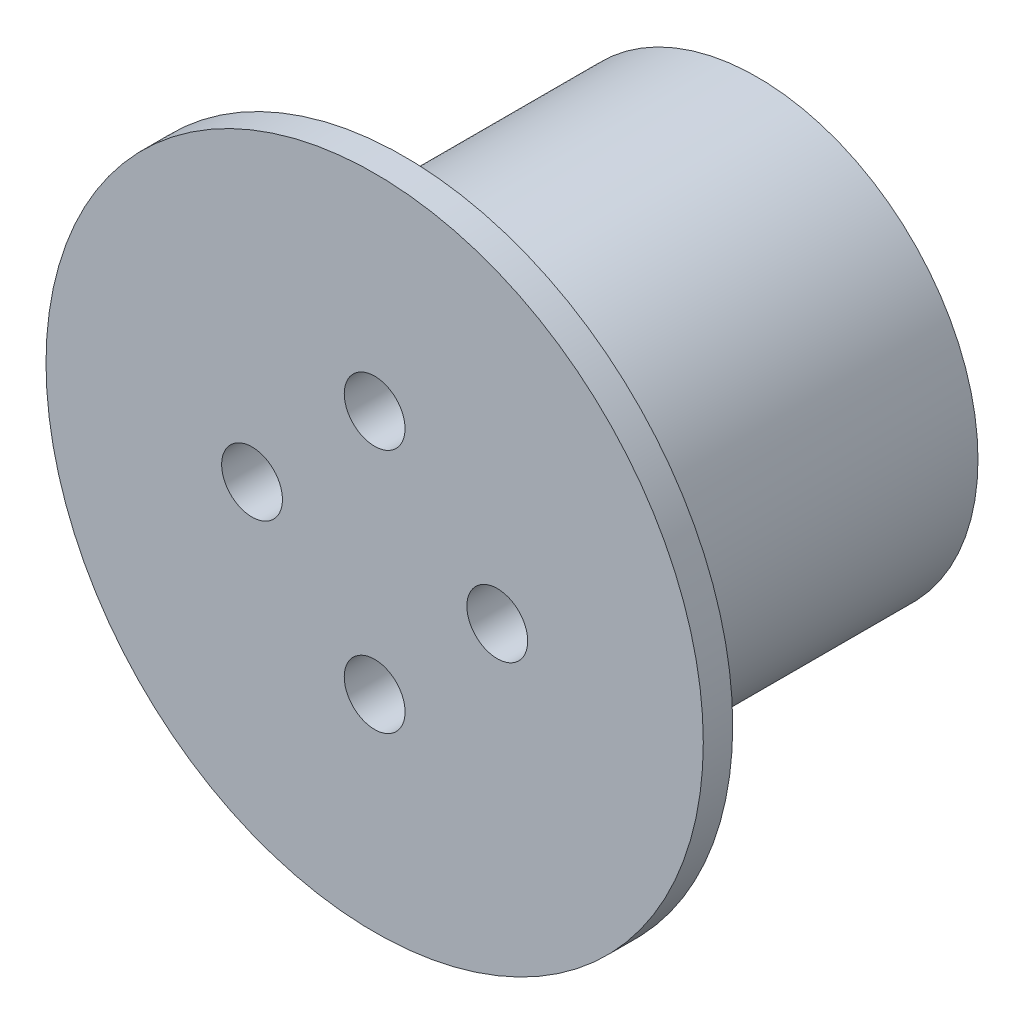
ISO-10303-21;
HEADER;
FILE_DESCRIPTION(('STEP AP214'),'2;1');
FILE_NAME('part.step','',(''),(''),'','','');
FILE_SCHEMA(('AUTOMOTIVE_DESIGN { 1 0 10303 214 1 1 1 1 }'));
ENDSEC;
DATA;
#1=APPLICATION_CONTEXT('core data for automotive mechanical design processes');
#2=APPLICATION_PROTOCOL_DEFINITION('international standard','automotive_design',2000,#1);
#3=PRODUCT_CONTEXT('',#1,'mechanical');
#4=PRODUCT('Part','Part','',(#3));
#5=PRODUCT_RELATED_PRODUCT_CATEGORY('part','',(#4));
#6=PRODUCT_DEFINITION_FORMATION('','',#4);
#7=PRODUCT_DEFINITION_CONTEXT('part definition',#1,'design');
#8=PRODUCT_DEFINITION('design','',#6,#7);
#9=PRODUCT_DEFINITION_SHAPE('','',#8);
#10=(LENGTH_UNIT() NAMED_UNIT(*) SI_UNIT(.MILLI.,.METRE.));
#11=(NAMED_UNIT(*) PLANE_ANGLE_UNIT() SI_UNIT($,.RADIAN.));
#12=(NAMED_UNIT(*) SI_UNIT($,.STERADIAN.) SOLID_ANGLE_UNIT());
#13=UNCERTAINTY_MEASURE_WITH_UNIT(LENGTH_MEASURE(1.E-05),#10,'distance_accuracy_value','');
#14=(GEOMETRIC_REPRESENTATION_CONTEXT(3) GLOBAL_UNCERTAINTY_ASSIGNED_CONTEXT((#13)) GLOBAL_UNIT_ASSIGNED_CONTEXT((#10,
#11,#12)) REPRESENTATION_CONTEXT('',''));
#15=CARTESIAN_POINT('',(0.,0.,0.));
#16=DIRECTION('',(0.,0.,1.));
#17=DIRECTION('',(1.,0.,0.));
#18=AXIS2_PLACEMENT_3D('',#15,#16,#17);
#19=CARTESIAN_POINT('',(0.,0.,36.));
#20=DIRECTION('',(0.,0.,-1.));
#21=DIRECTION('',(-1.,0.,0.));
#22=AXIS2_PLACEMENT_3D('',#19,#20,#21);
#23=CYLINDRICAL_SURFACE('',#22,22.5);
#24=CARTESIAN_POINT('',(0.,0.,36.));
#25=DIRECTION('',(0.,0.,1.));
#26=DIRECTION('',(1.,0.,0.));
#27=AXIS2_PLACEMENT_3D('',#24,#25,#26);
#28=CIRCLE('',#27,22.5);
#29=CARTESIAN_POINT('',(22.5,0.,36.));
#30=VERTEX_POINT('',#29);
#31=EDGE_CURVE('E10',#30,#30,#28,.T.);
#32=ORIENTED_EDGE('',*,*,#31,.F.);
#33=EDGE_LOOP('',(#32));
#34=FACE_BOUND('',#33,.T.);
#35=CARTESIAN_POINT('',(0.,0.,0.));
#36=DIRECTION('',(0.,0.,1.));
#37=DIRECTION('',(1.,0.,0.));
#38=AXIS2_PLACEMENT_3D('',#35,#36,#37);
#39=CIRCLE('',#38,22.5);
#40=CARTESIAN_POINT('',(22.5,0.,0.));
#41=VERTEX_POINT('',#40);
#42=EDGE_CURVE('E40',#41,#41,#39,.T.);
#43=ORIENTED_EDGE('',*,*,#42,.T.);
#44=EDGE_LOOP('',(#43));
#45=FACE_BOUND('',#44,.T.);
#46=ADVANCED_FACE('F37',(#34,#45),#23,.T.);
#47=CARTESIAN_POINT('',(0.,0.,0.));
#48=DIRECTION('',(0.,0.,1.));
#49=DIRECTION('',(1.,0.,0.));
#50=AXIS2_PLACEMENT_3D('',#47,#48,#49);
#51=PLANE('',#50);
#52=CARTESIAN_POINT('',(0.,15.,0.));
#53=DIRECTION('',(0.,0.,1.));
#54=DIRECTION('',(1.,0.,0.));
#55=AXIS2_PLACEMENT_3D('',#52,#53,#54);
#56=CIRCLE('',#55,2.25);
#57=CARTESIAN_POINT('',(2.25,15.,0.));
#58=VERTEX_POINT('',#57);
#59=EDGE_CURVE('E68',#58,#58,#56,.T.);
#60=ORIENTED_EDGE('',*,*,#59,.T.);
#61=EDGE_LOOP('',(#60));
#62=FACE_BOUND('',#61,.T.);
#63=CARTESIAN_POINT('',(-14.9999999999994,-6.3948846218409E-13,0.));
#64=DIRECTION('',(0.,0.,1.));
#65=DIRECTION('',(1.,0.,0.));
#66=AXIS2_PLACEMENT_3D('',#63,#64,#65);
#67=CIRCLE('',#66,2.25000000000122);
#68=CARTESIAN_POINT('',(-12.7499999999981,-6.3948846218409E-13,0.));
#69=VERTEX_POINT('',#68);
#70=EDGE_CURVE('E62',#69,#69,#67,.T.);
#71=ORIENTED_EDGE('',*,*,#70,.T.);
#72=EDGE_LOOP('',(#71));
#73=FACE_BOUND('',#72,.T.);
#74=CARTESIAN_POINT('',(1.27530298397074E-12,-15.,0.));
#75=DIRECTION('',(0.,0.,1.));
#76=DIRECTION('',(1.,0.,0.));
#77=AXIS2_PLACEMENT_3D('',#74,#75,#76);
#78=CIRCLE('',#77,2.25000000000157);
#79=CARTESIAN_POINT('',(2.25000000000285,-15.,0.));
#80=VERTEX_POINT('',#79);
#81=EDGE_CURVE('E56',#80,#80,#78,.T.);
#82=ORIENTED_EDGE('',*,*,#81,.T.);
#83=EDGE_LOOP('',(#82));
#84=FACE_BOUND('',#83,.T.);
#85=CARTESIAN_POINT('',(15.0000000000006,6.37651491985369E-13,0.));
#86=DIRECTION('',(0.,0.,1.));
#87=DIRECTION('',(1.,0.,0.));
#88=AXIS2_PLACEMENT_3D('',#85,#86,#87);
#89=CIRCLE('',#88,2.25000000000049);
#90=CARTESIAN_POINT('',(17.2500000000011,6.37651491985369E-13,0.));
#91=VERTEX_POINT('',#90);
#92=EDGE_CURVE('E49',#91,#91,#89,.T.);
#93=ORIENTED_EDGE('',*,*,#92,.T.);
#94=EDGE_LOOP('',(#93));
#95=FACE_BOUND('',#94,.T.);
#96=ORIENTED_EDGE('',*,*,#42,.F.);
#97=EDGE_LOOP('',(#96));
#98=FACE_BOUND('',#97,.T.);
#99=ADVANCED_FACE('F115',(#62,#73,#84,#95,#98),#51,.F.);
#100=CARTESIAN_POINT('',(15.0000000000006,6.37651491985369E-13,10.));
#101=DIRECTION('',(0.,0.,-1.));
#102=DIRECTION('',(-1.,0.,0.));
#103=AXIS2_PLACEMENT_3D('',#100,#101,#102);
#104=CYLINDRICAL_SURFACE('',#103,2.25000000000049);
#105=CARTESIAN_POINT('',(15.0000000000006,6.37651491985369E-13,10.));
#106=DIRECTION('',(0.,0.,1.));
#107=DIRECTION('',(1.,0.,0.));
#108=AXIS2_PLACEMENT_3D('',#105,#106,#107);
#109=CIRCLE('',#108,2.25000000000049);
#110=CARTESIAN_POINT('',(17.2500000000011,6.37651491985369E-13,10.));
#111=VERTEX_POINT('',#110);
#112=EDGE_CURVE('E52',#111,#111,#109,.T.);
#113=ORIENTED_EDGE('',*,*,#112,.T.);
#114=EDGE_LOOP('',(#113));
#115=FACE_BOUND('',#114,.T.);
#116=ORIENTED_EDGE('',*,*,#92,.F.);
#117=EDGE_LOOP('',(#116));
#118=FACE_BOUND('',#117,.T.);
#119=ADVANCED_FACE('F120',(#115,#118),#104,.F.);
#120=CARTESIAN_POINT('',(0.,0.,10.));
#121=DIRECTION('',(0.,0.,1.));
#122=DIRECTION('',(1.,0.,0.));
#123=AXIS2_PLACEMENT_3D('',#120,#121,#122);
#124=PLANE('',#123);
#125=ORIENTED_EDGE('',*,*,#112,.F.);
#126=EDGE_LOOP('',(#125));
#127=FACE_BOUND('',#126,.T.);
#128=ADVANCED_FACE('F128',(#127),#124,.F.);
#129=CARTESIAN_POINT('',(1.27530298397074E-12,-15.,10.));
#130=DIRECTION('',(0.,0.,-1.));
#131=DIRECTION('',(-1.,0.,0.));
#132=AXIS2_PLACEMENT_3D('',#129,#130,#131);
#133=CYLINDRICAL_SURFACE('',#132,2.25000000000157);
#134=CARTESIAN_POINT('',(1.27530298397074E-12,-15.,10.));
#135=DIRECTION('',(0.,0.,1.));
#136=DIRECTION('',(1.,0.,0.));
#137=AXIS2_PLACEMENT_3D('',#134,#135,#136);
#138=CIRCLE('',#137,2.25000000000157);
#139=CARTESIAN_POINT('',(2.25000000000285,-15.,10.));
#140=VERTEX_POINT('',#139);
#141=EDGE_CURVE('E59',#140,#140,#138,.T.);
#142=ORIENTED_EDGE('',*,*,#141,.T.);
#143=EDGE_LOOP('',(#142));
#144=FACE_BOUND('',#143,.T.);
#145=ORIENTED_EDGE('',*,*,#81,.F.);
#146=EDGE_LOOP('',(#145));
#147=FACE_BOUND('',#146,.T.);
#148=ADVANCED_FACE('F135',(#144,#147),#133,.F.);
#149=CARTESIAN_POINT('',(0.,0.,10.));
#150=DIRECTION('',(0.,0.,1.));
#151=DIRECTION('',(1.,0.,0.));
#152=AXIS2_PLACEMENT_3D('',#149,#150,#151);
#153=PLANE('',#152);
#154=ORIENTED_EDGE('',*,*,#141,.F.);
#155=EDGE_LOOP('',(#154));
#156=FACE_BOUND('',#155,.T.);
#157=ADVANCED_FACE('F139',(#156),#153,.F.);
#158=CARTESIAN_POINT('',(-14.9999999999994,-6.3948846218409E-13,10.));
#159=DIRECTION('',(0.,0.,-1.));
#160=DIRECTION('',(-1.,0.,0.));
#161=AXIS2_PLACEMENT_3D('',#158,#159,#160);
#162=CYLINDRICAL_SURFACE('',#161,2.25000000000122);
#163=CARTESIAN_POINT('',(-14.9999999999994,-6.3948846218409E-13,10.));
#164=DIRECTION('',(0.,0.,1.));
#165=DIRECTION('',(1.,0.,0.));
#166=AXIS2_PLACEMENT_3D('',#163,#164,#165);
#167=CIRCLE('',#166,2.25000000000122);
#168=CARTESIAN_POINT('',(-12.7499999999981,-6.3948846218409E-13,10.));
#169=VERTEX_POINT('',#168);
#170=EDGE_CURVE('E65',#169,#169,#167,.T.);
#171=ORIENTED_EDGE('',*,*,#170,.T.);
#172=EDGE_LOOP('',(#171));
#173=FACE_BOUND('',#172,.T.);
#174=ORIENTED_EDGE('',*,*,#70,.F.);
#175=EDGE_LOOP('',(#174));
#176=FACE_BOUND('',#175,.T.);
#177=ADVANCED_FACE('F143',(#173,#176),#162,.F.);
#178=CARTESIAN_POINT('',(0.,0.,10.));
#179=DIRECTION('',(0.,0.,1.));
#180=DIRECTION('',(1.,0.,0.));
#181=AXIS2_PLACEMENT_3D('',#178,#179,#180);
#182=PLANE('',#181);
#183=ORIENTED_EDGE('',*,*,#170,.F.);
#184=EDGE_LOOP('',(#183));
#185=FACE_BOUND('',#184,.T.);
#186=ADVANCED_FACE('F147',(#185),#182,.F.);
#187=CARTESIAN_POINT('',(0.,15.,10.));
#188=DIRECTION('',(0.,0.,-1.));
#189=DIRECTION('',(-1.,0.,0.));
#190=AXIS2_PLACEMENT_3D('',#187,#188,#189);
#191=CYLINDRICAL_SURFACE('',#190,2.25);
#192=CARTESIAN_POINT('',(0.,15.,10.));
#193=DIRECTION('',(0.,0.,1.));
#194=DIRECTION('',(1.,0.,0.));
#195=AXIS2_PLACEMENT_3D('',#192,#193,#194);
#196=CIRCLE('',#195,2.25);
#197=CARTESIAN_POINT('',(2.25,15.,10.));
#198=VERTEX_POINT('',#197);
#199=EDGE_CURVE('E47',#198,#198,#196,.T.);
#200=ORIENTED_EDGE('',*,*,#199,.T.);
#201=EDGE_LOOP('',(#200));
#202=FACE_BOUND('',#201,.T.);
#203=ORIENTED_EDGE('',*,*,#59,.F.);
#204=EDGE_LOOP('',(#203));
#205=FACE_BOUND('',#204,.T.);
#206=ADVANCED_FACE('F151',(#202,#205),#191,.F.);
#207=CARTESIAN_POINT('',(0.,0.,10.));
#208=DIRECTION('',(0.,0.,1.));
#209=DIRECTION('',(1.,0.,0.));
#210=AXIS2_PLACEMENT_3D('',#207,#208,#209);
#211=PLANE('',#210);
#212=ORIENTED_EDGE('',*,*,#199,.F.);
#213=EDGE_LOOP('',(#212));
#214=FACE_BOUND('',#213,.T.);
#215=ADVANCED_FACE('F155',(#214),#211,.F.);
#216=CARTESIAN_POINT('',(0.,0.,39.));
#217=DIRECTION('',(0.,0.,-1.));
#218=DIRECTION('',(-1.,0.,0.));
#219=AXIS2_PLACEMENT_3D('',#216,#217,#218);
#220=CYLINDRICAL_SURFACE('',#219,33.5);
#221=CARTESIAN_POINT('',(0.,0.,39.));
#222=DIRECTION('',(0.,0.,1.));
#223=DIRECTION('',(1.,0.,0.));
#224=AXIS2_PLACEMENT_3D('',#221,#222,#223);
#225=CIRCLE('',#224,33.5);
#226=CARTESIAN_POINT('',(33.5,0.,39.));
#227=VERTEX_POINT('',#226);
#228=EDGE_CURVE('E53',#227,#227,#225,.T.);
#229=ORIENTED_EDGE('',*,*,#228,.F.);
#230=EDGE_LOOP('',(#229));
#231=FACE_BOUND('',#230,.T.);
#232=CARTESIAN_POINT('',(0.,0.,36.));
#233=DIRECTION('',(0.,0.,1.));
#234=DIRECTION('',(1.,0.,0.));
#235=AXIS2_PLACEMENT_3D('',#232,#233,#234);
#236=CIRCLE('',#235,33.5);
#237=CARTESIAN_POINT('',(33.5,0.,36.));
#238=VERTEX_POINT('',#237);
#239=EDGE_CURVE('E73',#238,#238,#236,.T.);
#240=ORIENTED_EDGE('',*,*,#239,.T.);
#241=EDGE_LOOP('',(#240));
#242=FACE_BOUND('',#241,.T.);
#243=ADVANCED_FACE('F159',(#231,#242),#220,.T.);
#244=CARTESIAN_POINT('',(0.,0.,39.));
#245=DIRECTION('',(0.,0.,1.));
#246=DIRECTION('',(1.,0.,0.));
#247=AXIS2_PLACEMENT_3D('',#244,#245,#246);
#248=PLANE('',#247);
#249=CARTESIAN_POINT('',(12.5,0.,39.));
#250=DIRECTION('',(0.,0.,-1.));
#251=DIRECTION('',(-1.,0.,0.));
#252=AXIS2_PLACEMENT_3D('',#249,#250,#251);
#253=CIRCLE('',#252,3.1);
#254=CARTESIAN_POINT('',(9.4,0.,39.));
#255=VERTEX_POINT('',#254);
#256=EDGE_CURVE('E76',#255,#255,#253,.T.);
#257=ORIENTED_EDGE('',*,*,#256,.T.);
#258=EDGE_LOOP('',(#257));
#259=FACE_BOUND('',#258,.T.);
#260=CARTESIAN_POINT('',(0.,12.5,39.));
#261=DIRECTION('',(0.,0.,-1.));
#262=DIRECTION('',(-1.,0.,0.));
#263=AXIS2_PLACEMENT_3D('',#260,#261,#262);
#264=CIRCLE('',#263,3.1);
#265=CARTESIAN_POINT('',(-3.10000000000004,12.5,39.));
#266=VERTEX_POINT('',#265);
#267=EDGE_CURVE('E92',#266,#266,#264,.T.);
#268=ORIENTED_EDGE('',*,*,#267,.T.);
#269=EDGE_LOOP('',(#268));
#270=FACE_BOUND('',#269,.T.);
#271=CARTESIAN_POINT('',(-12.5,0.,39.));
#272=DIRECTION('',(0.,0.,-1.));
#273=DIRECTION('',(-1.,0.,0.));
#274=AXIS2_PLACEMENT_3D('',#271,#272,#273);
#275=CIRCLE('',#274,3.1);
#276=CARTESIAN_POINT('',(-15.6,0.,39.));
#277=VERTEX_POINT('',#276);
#278=EDGE_CURVE('E86',#277,#277,#275,.T.);
#279=ORIENTED_EDGE('',*,*,#278,.T.);
#280=EDGE_LOOP('',(#279));
#281=FACE_BOUND('',#280,.T.);
#282=CARTESIAN_POINT('',(1.30930550206618E-13,-12.5,39.));
#283=DIRECTION('',(0.,0.,-1.));
#284=DIRECTION('',(-1.,0.,0.));
#285=AXIS2_PLACEMENT_3D('',#282,#283,#284);
#286=CIRCLE('',#285,3.1);
#287=CARTESIAN_POINT('',(-3.09999999999987,-12.5,39.));
#288=VERTEX_POINT('',#287);
#289=EDGE_CURVE('E79',#288,#288,#286,.T.);
#290=ORIENTED_EDGE('',*,*,#289,.T.);
#291=EDGE_LOOP('',(#290));
#292=FACE_BOUND('',#291,.T.);
#293=ORIENTED_EDGE('',*,*,#228,.T.);
#294=EDGE_LOOP('',(#293));
#295=FACE_BOUND('',#294,.T.);
#296=ADVANCED_FACE('F163',(#259,#270,#281,#292,#295),#248,.T.);
#297=CARTESIAN_POINT('',(0.,0.,36.));
#298=DIRECTION('',(0.,0.,1.));
#299=DIRECTION('',(1.,0.,0.));
#300=AXIS2_PLACEMENT_3D('',#297,#298,#299);
#301=PLANE('',#300);
#302=ORIENTED_EDGE('',*,*,#31,.T.);
#303=EDGE_LOOP('',(#302));
#304=FACE_BOUND('',#303,.T.);
#305=ORIENTED_EDGE('',*,*,#239,.F.);
#306=EDGE_LOOP('',(#305));
#307=FACE_BOUND('',#306,.T.);
#308=ADVANCED_FACE('F165',(#304,#307),#301,.F.);
#309=CARTESIAN_POINT('',(1.30930550206618E-13,-12.5,39.));
#310=DIRECTION('',(0.,0.,-1.));
#311=DIRECTION('',(-1.,0.,0.));
#312=AXIS2_PLACEMENT_3D('',#309,#310,#311);
#313=CYLINDRICAL_SURFACE('',#312,3.1);
#314=ORIENTED_EDGE('',*,*,#289,.F.);
#315=EDGE_LOOP('',(#314));
#316=FACE_BOUND('',#315,.T.);
#317=CARTESIAN_POINT('',(1.30930550206618E-13,-12.5,26.));
#318=DIRECTION('',(0.,0.,-1.));
#319=DIRECTION('',(-1.,0.,0.));
#320=AXIS2_PLACEMENT_3D('',#317,#318,#319);
#321=CIRCLE('',#320,3.1);
#322=CARTESIAN_POINT('',(-3.09999999999987,-12.5,26.));
#323=VERTEX_POINT('',#322);
#324=EDGE_CURVE('E83',#323,#323,#321,.T.);
#325=ORIENTED_EDGE('',*,*,#324,.T.);
#326=EDGE_LOOP('',(#325));
#327=FACE_BOUND('',#326,.T.);
#328=ADVANCED_FACE('F168',(#316,#327),#313,.F.);
#329=CARTESIAN_POINT('',(1.30930550206618E-13,-12.5,26.));
#330=DIRECTION('',(0.,0.,-1.));
#331=DIRECTION('',(-1.,0.,0.));
#332=AXIS2_PLACEMENT_3D('',#329,#330,#331);
#333=PLANE('',#332);
#334=ORIENTED_EDGE('',*,*,#324,.F.);
#335=EDGE_LOOP('',(#334));
#336=FACE_BOUND('',#335,.T.);
#337=ADVANCED_FACE('F174',(#336),#333,.F.);
#338=CARTESIAN_POINT('',(-12.5,0.,39.));
#339=DIRECTION('',(0.,0.,-1.));
#340=DIRECTION('',(-1.,0.,0.));
#341=AXIS2_PLACEMENT_3D('',#338,#339,#340);
#342=CYLINDRICAL_SURFACE('',#341,3.1);
#343=ORIENTED_EDGE('',*,*,#278,.F.);
#344=EDGE_LOOP('',(#343));
#345=FACE_BOUND('',#344,.T.);
#346=CARTESIAN_POINT('',(-12.5,0.,26.));
#347=DIRECTION('',(0.,0.,-1.));
#348=DIRECTION('',(-1.,0.,0.));
#349=AXIS2_PLACEMENT_3D('',#346,#347,#348);
#350=CIRCLE('',#349,3.1);
#351=CARTESIAN_POINT('',(-15.6,0.,26.));
#352=VERTEX_POINT('',#351);
#353=EDGE_CURVE('E82',#352,#352,#350,.T.);
#354=ORIENTED_EDGE('',*,*,#353,.T.);
#355=EDGE_LOOP('',(#354));
#356=FACE_BOUND('',#355,.T.);
#357=ADVANCED_FACE('F178',(#345,#356),#342,.F.);
#358=CARTESIAN_POINT('',(-12.5,0.,26.));
#359=DIRECTION('',(0.,0.,-1.));
#360=DIRECTION('',(-1.,0.,0.));
#361=AXIS2_PLACEMENT_3D('',#358,#359,#360);
#362=PLANE('',#361);
#363=ORIENTED_EDGE('',*,*,#353,.F.);
#364=EDGE_LOOP('',(#363));
#365=FACE_BOUND('',#364,.T.);
#366=ADVANCED_FACE('F182',(#365),#362,.F.);
#367=CARTESIAN_POINT('',(0.,12.5,39.));
#368=DIRECTION('',(0.,0.,-1.));
#369=DIRECTION('',(-1.,0.,0.));
#370=AXIS2_PLACEMENT_3D('',#367,#368,#369);
#371=CYLINDRICAL_SURFACE('',#370,3.1);
#372=ORIENTED_EDGE('',*,*,#267,.F.);
#373=EDGE_LOOP('',(#372));
#374=FACE_BOUND('',#373,.T.);
#375=CARTESIAN_POINT('',(0.,12.5,26.));
#376=DIRECTION('',(0.,0.,-1.));
#377=DIRECTION('',(-1.,0.,0.));
#378=AXIS2_PLACEMENT_3D('',#375,#376,#377);
#379=CIRCLE('',#378,3.1);
#380=CARTESIAN_POINT('',(-3.10000000000004,12.5,26.));
#381=VERTEX_POINT('',#380);
#382=EDGE_CURVE('E89',#381,#381,#379,.T.);
#383=ORIENTED_EDGE('',*,*,#382,.T.);
#384=EDGE_LOOP('',(#383));
#385=FACE_BOUND('',#384,.T.);
#386=ADVANCED_FACE('F186',(#374,#385),#371,.F.);
#387=CARTESIAN_POINT('',(0.,12.5,26.));
#388=DIRECTION('',(0.,0.,-1.));
#389=DIRECTION('',(-1.,0.,0.));
#390=AXIS2_PLACEMENT_3D('',#387,#388,#389);
#391=PLANE('',#390);
#392=ORIENTED_EDGE('',*,*,#382,.F.);
#393=EDGE_LOOP('',(#392));
#394=FACE_BOUND('',#393,.T.);
#395=ADVANCED_FACE('F111',(#394),#391,.F.);
#396=CARTESIAN_POINT('',(12.5,0.,39.));
#397=DIRECTION('',(0.,0.,-1.));
#398=DIRECTION('',(-1.,0.,0.));
#399=AXIS2_PLACEMENT_3D('',#396,#397,#398);
#400=CYLINDRICAL_SURFACE('',#399,3.1);
#401=ORIENTED_EDGE('',*,*,#256,.F.);
#402=EDGE_LOOP('',(#401));
#403=FACE_BOUND('',#402,.T.);
#404=CARTESIAN_POINT('',(12.5,0.,26.));
#405=DIRECTION('',(0.,0.,-1.));
#406=DIRECTION('',(-1.,0.,0.));
#407=AXIS2_PLACEMENT_3D('',#404,#405,#406);
#408=CIRCLE('',#407,3.1);
#409=CARTESIAN_POINT('',(9.4,0.,26.));
#410=VERTEX_POINT('',#409);
#411=EDGE_CURVE('E95',#410,#410,#408,.T.);
#412=ORIENTED_EDGE('',*,*,#411,.T.);
#413=EDGE_LOOP('',(#412));
#414=FACE_BOUND('',#413,.T.);
#415=ADVANCED_FACE('F103',(#403,#414),#400,.F.);
#416=CARTESIAN_POINT('',(12.5,0.,26.));
#417=DIRECTION('',(0.,0.,-1.));
#418=DIRECTION('',(-1.,0.,0.));
#419=AXIS2_PLACEMENT_3D('',#416,#417,#418);
#420=PLANE('',#419);
#421=ORIENTED_EDGE('',*,*,#411,.F.);
#422=EDGE_LOOP('',(#421));
#423=FACE_BOUND('',#422,.T.);
#424=ADVANCED_FACE('F105',(#423),#420,.F.);
#425=CLOSED_SHELL('',(#46,#99,#119,#128,#148,#157,#177,#186,#206,#215,#243,#296,#308,#328,#337,
#357,#366,#386,#395,#415,#424));
#426=MANIFOLD_SOLID_BREP('B2',#425);
#427=ADVANCED_BREP_SHAPE_REPRESENTATION('',(#18,#426),#14);
#428=SHAPE_DEFINITION_REPRESENTATION(#9,#427);
ENDSEC;
END-ISO-10303-21;
